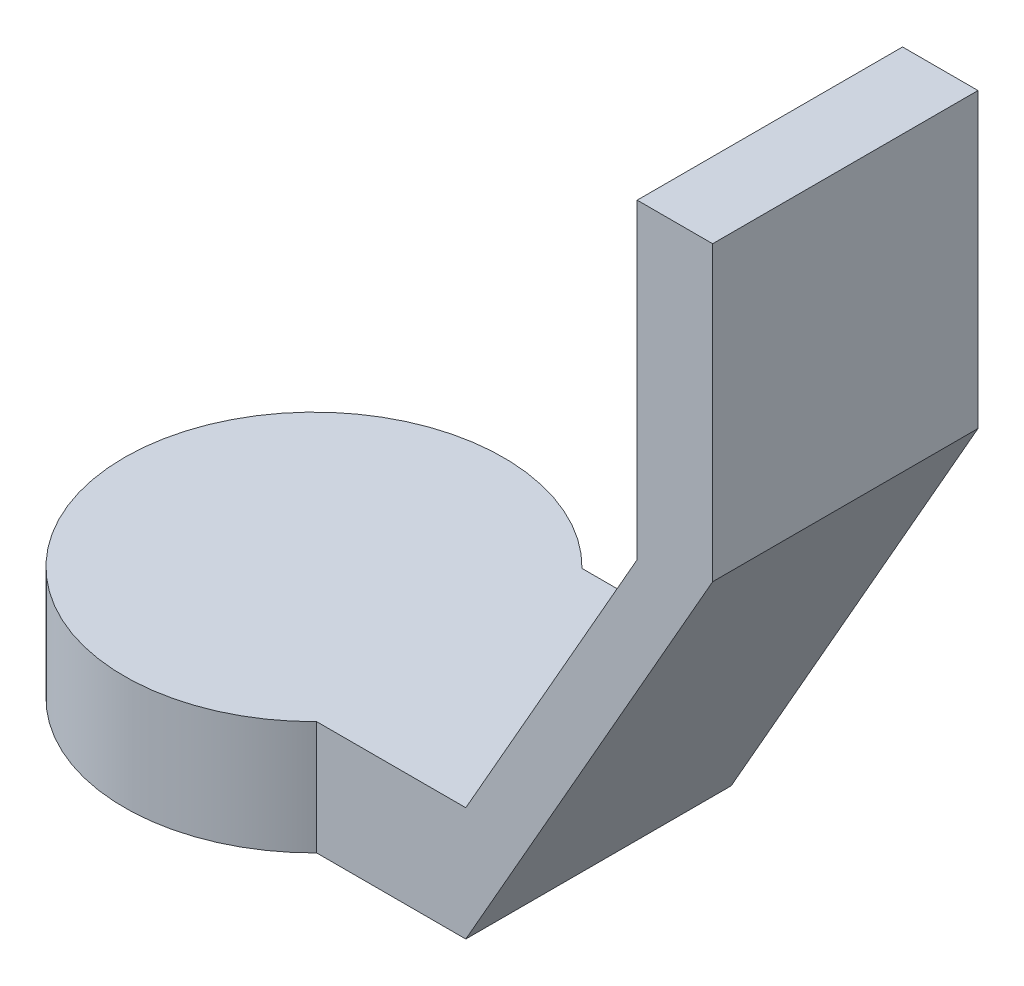
ISO-10303-21;
HEADER;
FILE_DESCRIPTION(('STEP AP214'),'2;1');
FILE_NAME('part.step','',(''),(''),'','','');
FILE_SCHEMA(('AUTOMOTIVE_DESIGN { 1 0 10303 214 1 1 1 1 }'));
ENDSEC;
DATA;
#1=APPLICATION_CONTEXT('core data for automotive mechanical design processes');
#2=APPLICATION_PROTOCOL_DEFINITION('international standard','automotive_design',2000,#1);
#3=PRODUCT_CONTEXT('',#1,'mechanical');
#4=PRODUCT('Part','Part','',(#3));
#5=PRODUCT_RELATED_PRODUCT_CATEGORY('part','',(#4));
#6=PRODUCT_DEFINITION_FORMATION('','',#4);
#7=PRODUCT_DEFINITION_CONTEXT('part definition',#1,'design');
#8=PRODUCT_DEFINITION('design','',#6,#7);
#9=PRODUCT_DEFINITION_SHAPE('','',#8);
#10=(LENGTH_UNIT() NAMED_UNIT(*) SI_UNIT(.MILLI.,.METRE.));
#11=(NAMED_UNIT(*) PLANE_ANGLE_UNIT() SI_UNIT($,.RADIAN.));
#12=(NAMED_UNIT(*) SI_UNIT($,.STERADIAN.) SOLID_ANGLE_UNIT());
#13=UNCERTAINTY_MEASURE_WITH_UNIT(LENGTH_MEASURE(1.E-05),#10,'distance_accuracy_value','');
#14=(GEOMETRIC_REPRESENTATION_CONTEXT(3) GLOBAL_UNCERTAINTY_ASSIGNED_CONTEXT((#13)) GLOBAL_UNIT_ASSIGNED_CONTEXT((#10,
#11,#12)) REPRESENTATION_CONTEXT('',''));
#15=CARTESIAN_POINT('',(0.,0.,0.));
#16=DIRECTION('',(0.,0.,1.));
#17=DIRECTION('',(1.,0.,0.));
#18=AXIS2_PLACEMENT_3D('',#15,#16,#17);
#19=CARTESIAN_POINT('',(0.,30.,0.));
#20=DIRECTION('',(0.,-1.,0.));
#21=DIRECTION('',(0.,0.,-1.));
#22=AXIS2_PLACEMENT_3D('',#19,#20,#21);
#23=CYLINDRICAL_SURFACE('',#22,50.);
#24=CARTESIAN_POINT('',(0.,0.,0.));
#25=DIRECTION('',(0.,1.,0.));
#26=DIRECTION('',(0.,0.,1.));
#27=AXIS2_PLACEMENT_3D('',#24,#25,#26);
#28=CIRCLE('',#27,50.);
#29=CARTESIAN_POINT('',(35.7071421427143,0.,-35.));
#30=VERTEX_POINT('',#29);
#31=CARTESIAN_POINT('',(35.7071421427143,0.,35.));
#32=VERTEX_POINT('',#31);
#33=EDGE_CURVE('E150',#30,#32,#28,.T.);
#34=ORIENTED_EDGE('',*,*,#33,.T.);
#35=DIRECTION('',(0.,-1.,0.));
#36=VECTOR('',#35,1.);
#37=CARTESIAN_POINT('',(35.7071421427143,30.,35.));
#38=LINE('',#37,#36);
#39=CARTESIAN_POINT('',(35.7071421427143,30.,35.));
#40=VERTEX_POINT('',#39);
#41=EDGE_CURVE('E11',#40,#32,#38,.T.);
#42=ORIENTED_EDGE('',*,*,#41,.F.);
#43=CARTESIAN_POINT('',(0.,30.,0.));
#44=DIRECTION('',(0.,1.,0.));
#45=DIRECTION('',(0.,0.,1.));
#46=AXIS2_PLACEMENT_3D('',#43,#44,#45);
#47=CIRCLE('',#46,50.);
#48=CARTESIAN_POINT('',(35.7071421427143,30.,-35.));
#49=VERTEX_POINT('',#48);
#50=EDGE_CURVE('E154',#49,#40,#47,.T.);
#51=ORIENTED_EDGE('',*,*,#50,.F.);
#52=DIRECTION('',(0.,-1.,0.));
#53=VECTOR('',#52,1.);
#54=CARTESIAN_POINT('',(35.7071421427143,30.,-35.));
#55=LINE('',#54,#53);
#56=EDGE_CURVE('E44',#49,#30,#55,.T.);
#57=ORIENTED_EDGE('',*,*,#56,.T.);
#58=EDGE_LOOP('',(#34,#42,#51,#57));
#59=FACE_BOUND('',#58,.T.);
#60=ADVANCED_FACE('F36',(#59),#23,.T.);
#61=CARTESIAN_POINT('',(0.,30.,35.));
#62=DIRECTION('',(0.,0.,-1.));
#63=DIRECTION('',(-1.,0.,0.));
#64=AXIS2_PLACEMENT_3D('',#61,#62,#63);
#65=PLANE('',#64);
#66=DIRECTION('',(1.,0.,0.));
#67=VECTOR('',#66,1.);
#68=CARTESIAN_POINT('',(0.,0.,35.));
#69=LINE('',#68,#67);
#70=CARTESIAN_POINT('',(75.0554768047186,0.,35.));
#71=VERTEX_POINT('',#70);
#72=EDGE_CURVE('E163',#32,#71,#69,.T.);
#73=ORIENTED_EDGE('',*,*,#72,.T.);
#74=DIRECTION('',(0.495370386359118,0.868681863698338,0.));
#75=VECTOR('',#74,1.);
#76=CARTESIAN_POINT('',(75.0554768047186,0.,35.));
#77=LINE('',#76,#75);
#78=CARTESIAN_POINT('',(140.174133176639,114.192122372215,35.));
#79=VERTEX_POINT('',#78);
#80=EDGE_CURVE('E131',#71,#79,#77,.T.);
#81=ORIENTED_EDGE('',*,*,#80,.T.);
#82=DIRECTION('',(0.,1.,0.));
#83=VECTOR('',#82,1.);
#84=CARTESIAN_POINT('',(140.174133176639,114.192122372215,35.));
#85=LINE('',#84,#83);
#86=CARTESIAN_POINT('',(140.174133176639,191.411564080646,35.));
#87=VERTEX_POINT('',#86);
#88=EDGE_CURVE('E142',#79,#87,#85,.T.);
#89=ORIENTED_EDGE('',*,*,#88,.T.);
#90=DIRECTION('',(-1.,0.,0.));
#91=VECTOR('',#90,1.);
#92=CARTESIAN_POINT('',(140.174133176639,191.411564080646,35.));
#93=LINE('',#92,#91);
#94=CARTESIAN_POINT('',(120.268900550481,191.411564080646,35.));
#95=VERTEX_POINT('',#94);
#96=EDGE_CURVE('E111',#87,#95,#93,.T.);
#97=ORIENTED_EDGE('',*,*,#96,.T.);
#98=DIRECTION('',(0.,-1.,0.));
#99=VECTOR('',#98,1.);
#100=CARTESIAN_POINT('',(120.268900550481,191.411564080646,35.));
#101=LINE('',#100,#99);
#102=CARTESIAN_POINT('',(120.268900550481,109.286292207177,35.));
#103=VERTEX_POINT('',#102);
#104=EDGE_CURVE('E145',#95,#103,#101,.T.);
#105=ORIENTED_EDGE('',*,*,#104,.T.);
#106=DIRECTION('',(-0.495370386359125,-0.868681863698334,0.));
#107=VECTOR('',#106,1.);
#108=CARTESIAN_POINT('',(120.268900550481,109.286292207177,35.));
#109=LINE('',#108,#107);
#110=CARTESIAN_POINT('',(75.0554768047186,30.,35.));
#111=VERTEX_POINT('',#110);
#112=EDGE_CURVE('E134',#103,#111,#109,.T.);
#113=ORIENTED_EDGE('',*,*,#112,.T.);
#114=DIRECTION('',(1.,0.,0.));
#115=VECTOR('',#114,1.);
#116=CARTESIAN_POINT('',(0.,30.,35.));
#117=LINE('',#116,#115);
#118=EDGE_CURVE('E76',#40,#111,#117,.T.);
#119=ORIENTED_EDGE('',*,*,#118,.F.);
#120=ORIENTED_EDGE('',*,*,#41,.T.);
#121=EDGE_LOOP('',(#73,#81,#89,#97,#105,#113,#119,#120));
#122=FACE_BOUND('',#121,.T.);
#123=ADVANCED_FACE('F171',(#122),#65,.F.);
#124=CARTESIAN_POINT('',(0.,30.,-35.));
#125=DIRECTION('',(0.,0.,-1.));
#126=DIRECTION('',(-1.,0.,0.));
#127=AXIS2_PLACEMENT_3D('',#124,#125,#126);
#128=PLANE('',#127);
#129=DIRECTION('',(1.,0.,0.));
#130=VECTOR('',#129,1.);
#131=CARTESIAN_POINT('',(0.,0.,-35.));
#132=LINE('',#131,#130);
#133=CARTESIAN_POINT('',(75.0554768047186,0.,-35.));
#134=VERTEX_POINT('',#133);
#135=EDGE_CURVE('E66',#30,#134,#132,.T.);
#136=ORIENTED_EDGE('',*,*,#135,.F.);
#137=ORIENTED_EDGE('',*,*,#56,.F.);
#138=DIRECTION('',(1.,0.,0.));
#139=VECTOR('',#138,1.);
#140=CARTESIAN_POINT('',(0.,30.,-35.));
#141=LINE('',#140,#139);
#142=CARTESIAN_POINT('',(75.0554768047186,30.,-35.));
#143=VERTEX_POINT('',#142);
#144=EDGE_CURVE('E160',#49,#143,#141,.T.);
#145=ORIENTED_EDGE('',*,*,#144,.T.);
#146=DIRECTION('',(-0.495370386359125,-0.868681863698334,0.));
#147=VECTOR('',#146,1.);
#148=CARTESIAN_POINT('',(120.268900550481,109.286292207177,-35.));
#149=LINE('',#148,#147);
#150=CARTESIAN_POINT('',(120.268900550481,109.286292207177,-35.));
#151=VERTEX_POINT('',#150);
#152=EDGE_CURVE('E138',#151,#143,#149,.T.);
#153=ORIENTED_EDGE('',*,*,#152,.F.);
#154=DIRECTION('',(0.,-1.,0.));
#155=VECTOR('',#154,1.);
#156=CARTESIAN_POINT('',(120.268900550481,191.411564080646,-35.));
#157=LINE('',#156,#155);
#158=CARTESIAN_POINT('',(120.268900550481,191.411564080646,-35.));
#159=VERTEX_POINT('',#158);
#160=EDGE_CURVE('E127',#159,#151,#157,.T.);
#161=ORIENTED_EDGE('',*,*,#160,.F.);
#162=DIRECTION('',(-1.,0.,0.));
#163=VECTOR('',#162,1.);
#164=CARTESIAN_POINT('',(140.174133176639,191.411564080646,-35.));
#165=LINE('',#164,#163);
#166=CARTESIAN_POINT('',(140.174133176639,191.411564080646,-35.));
#167=VERTEX_POINT('',#166);
#168=EDGE_CURVE('E109',#167,#159,#165,.T.);
#169=ORIENTED_EDGE('',*,*,#168,.F.);
#170=DIRECTION('',(0.,1.,0.));
#171=VECTOR('',#170,1.);
#172=CARTESIAN_POINT('',(140.174133176639,114.192122372215,-35.));
#173=LINE('',#172,#171);
#174=CARTESIAN_POINT('',(140.174133176639,114.192122372215,-35.));
#175=VERTEX_POINT('',#174);
#176=EDGE_CURVE('E123',#175,#167,#173,.T.);
#177=ORIENTED_EDGE('',*,*,#176,.F.);
#178=DIRECTION('',(0.495370386359118,0.868681863698338,0.));
#179=VECTOR('',#178,1.);
#180=CARTESIAN_POINT('',(75.0554768047186,0.,-35.));
#181=LINE('',#180,#179);
#182=EDGE_CURVE('E117',#134,#175,#181,.T.);
#183=ORIENTED_EDGE('',*,*,#182,.F.);
#184=EDGE_LOOP('',(#136,#137,#145,#153,#161,#169,#177,#183));
#185=FACE_BOUND('',#184,.T.);
#186=ADVANCED_FACE('F121',(#185),#128,.T.);
#187=CARTESIAN_POINT('',(0.,30.,0.));
#188=DIRECTION('',(0.,1.,0.));
#189=DIRECTION('',(0.,0.,1.));
#190=AXIS2_PLACEMENT_3D('',#187,#188,#189);
#191=PLANE('',#190);
#192=ORIENTED_EDGE('',*,*,#50,.T.);
#193=ORIENTED_EDGE('',*,*,#118,.T.);
#194=DIRECTION('',(0.,0.,1.));
#195=VECTOR('',#194,1.);
#196=CARTESIAN_POINT('',(75.0554768047186,30.,0.));
#197=LINE('',#196,#195);
#198=EDGE_CURVE('E157',#143,#111,#197,.T.);
#199=ORIENTED_EDGE('',*,*,#198,.F.);
#200=ORIENTED_EDGE('',*,*,#144,.F.);
#201=EDGE_LOOP('',(#192,#193,#199,#200));
#202=FACE_BOUND('',#201,.T.);
#203=ADVANCED_FACE('F182',(#202),#191,.T.);
#204=CARTESIAN_POINT('',(0.,0.,0.));
#205=DIRECTION('',(0.,1.,0.));
#206=DIRECTION('',(0.,0.,1.));
#207=AXIS2_PLACEMENT_3D('',#204,#205,#206);
#208=PLANE('',#207);
#209=ORIENTED_EDGE('',*,*,#33,.F.);
#210=ORIENTED_EDGE('',*,*,#135,.T.);
#211=DIRECTION('',(0.,0.,1.));
#212=VECTOR('',#211,1.);
#213=CARTESIAN_POINT('',(75.0554768047186,0.,0.));
#214=LINE('',#213,#212);
#215=EDGE_CURVE('E166',#134,#71,#214,.T.);
#216=ORIENTED_EDGE('',*,*,#215,.T.);
#217=ORIENTED_EDGE('',*,*,#72,.F.);
#218=EDGE_LOOP('',(#209,#210,#216,#217));
#219=FACE_BOUND('',#218,.T.);
#220=ADVANCED_FACE('F168',(#219),#208,.F.);
#221=CARTESIAN_POINT('',(140.174133176639,114.192122372215,-35.));
#222=DIRECTION('',(1.,0.,0.));
#223=DIRECTION('',(0.,0.,-1.));
#224=AXIS2_PLACEMENT_3D('',#221,#222,#223);
#225=PLANE('',#224);
#226=ORIENTED_EDGE('',*,*,#88,.F.);
#227=DIRECTION('',(0.,0.,1.));
#228=VECTOR('',#227,1.);
#229=CARTESIAN_POINT('',(140.174133176639,114.192122372215,-35.));
#230=LINE('',#229,#228);
#231=EDGE_CURVE('E130',#175,#79,#230,.T.);
#232=ORIENTED_EDGE('',*,*,#231,.F.);
#233=ORIENTED_EDGE('',*,*,#176,.T.);
#234=DIRECTION('',(0.,0.,1.));
#235=VECTOR('',#234,1.);
#236=CARTESIAN_POINT('',(140.174133176639,191.411564080646,-35.));
#237=LINE('',#236,#235);
#238=EDGE_CURVE('E106',#167,#87,#237,.T.);
#239=ORIENTED_EDGE('',*,*,#238,.T.);
#240=EDGE_LOOP('',(#226,#232,#233,#239));
#241=FACE_BOUND('',#240,.T.);
#242=ADVANCED_FACE('F129',(#241),#225,.T.);
#243=CARTESIAN_POINT('',(75.0554768047186,0.,-35.));
#244=DIRECTION('',(0.868681863698338,-0.495370386359118,0.));
#245=DIRECTION('',(0.495370386359118,0.868681863698338,0.));
#246=AXIS2_PLACEMENT_3D('',#243,#244,#245);
#247=PLANE('',#246);
#248=ORIENTED_EDGE('',*,*,#80,.F.);
#249=ORIENTED_EDGE('',*,*,#215,.F.);
#250=ORIENTED_EDGE('',*,*,#182,.T.);
#251=ORIENTED_EDGE('',*,*,#231,.T.);
#252=EDGE_LOOP('',(#248,#249,#250,#251));
#253=FACE_BOUND('',#252,.T.);
#254=ADVANCED_FACE('F173',(#253),#247,.T.);
#255=CARTESIAN_POINT('',(120.268900550481,109.286292207177,-35.));
#256=DIRECTION('',(-0.868681863698334,0.495370386359125,0.));
#257=DIRECTION('',(-0.495370386359125,-0.868681863698334,0.));
#258=AXIS2_PLACEMENT_3D('',#255,#256,#257);
#259=PLANE('',#258);
#260=ORIENTED_EDGE('',*,*,#112,.F.);
#261=DIRECTION('',(0.,0.,1.));
#262=VECTOR('',#261,1.);
#263=CARTESIAN_POINT('',(120.268900550481,109.286292207177,-35.));
#264=LINE('',#263,#262);
#265=EDGE_CURVE('E151',#151,#103,#264,.T.);
#266=ORIENTED_EDGE('',*,*,#265,.F.);
#267=ORIENTED_EDGE('',*,*,#152,.T.);
#268=ORIENTED_EDGE('',*,*,#198,.T.);
#269=EDGE_LOOP('',(#260,#266,#267,#268));
#270=FACE_BOUND('',#269,.T.);
#271=ADVANCED_FACE('F179',(#270),#259,.T.);
#272=CARTESIAN_POINT('',(120.268900550481,191.411564080646,-35.));
#273=DIRECTION('',(-1.,0.,0.));
#274=DIRECTION('',(0.,-1.,0.));
#275=AXIS2_PLACEMENT_3D('',#272,#273,#274);
#276=PLANE('',#275);
#277=ORIENTED_EDGE('',*,*,#104,.F.);
#278=DIRECTION('',(0.,0.,1.));
#279=VECTOR('',#278,1.);
#280=CARTESIAN_POINT('',(120.268900550481,191.411564080646,-35.));
#281=LINE('',#280,#279);
#282=EDGE_CURVE('E116',#159,#95,#281,.T.);
#283=ORIENTED_EDGE('',*,*,#282,.F.);
#284=ORIENTED_EDGE('',*,*,#160,.T.);
#285=ORIENTED_EDGE('',*,*,#265,.T.);
#286=EDGE_LOOP('',(#277,#283,#284,#285));
#287=FACE_BOUND('',#286,.T.);
#288=ADVANCED_FACE('F177',(#287),#276,.T.);
#289=CARTESIAN_POINT('',(140.174133176639,191.411564080646,-35.));
#290=DIRECTION('',(0.,1.,0.));
#291=DIRECTION('',(0.,0.,1.));
#292=AXIS2_PLACEMENT_3D('',#289,#290,#291);
#293=PLANE('',#292);
#294=ORIENTED_EDGE('',*,*,#96,.F.);
#295=ORIENTED_EDGE('',*,*,#238,.F.);
#296=ORIENTED_EDGE('',*,*,#168,.T.);
#297=ORIENTED_EDGE('',*,*,#282,.T.);
#298=EDGE_LOOP('',(#294,#295,#296,#297));
#299=FACE_BOUND('',#298,.T.);
#300=ADVANCED_FACE('F108',(#299),#293,.T.);
#301=CLOSED_SHELL('',(#60,#123,#186,#203,#220,#242,#254,#271,#288,#300));
#302=MANIFOLD_SOLID_BREP('B2',#301);
#303=ADVANCED_BREP_SHAPE_REPRESENTATION('',(#18,#302),#14);
#304=SHAPE_DEFINITION_REPRESENTATION(#9,#303);
ENDSEC;
END-ISO-10303-21;
